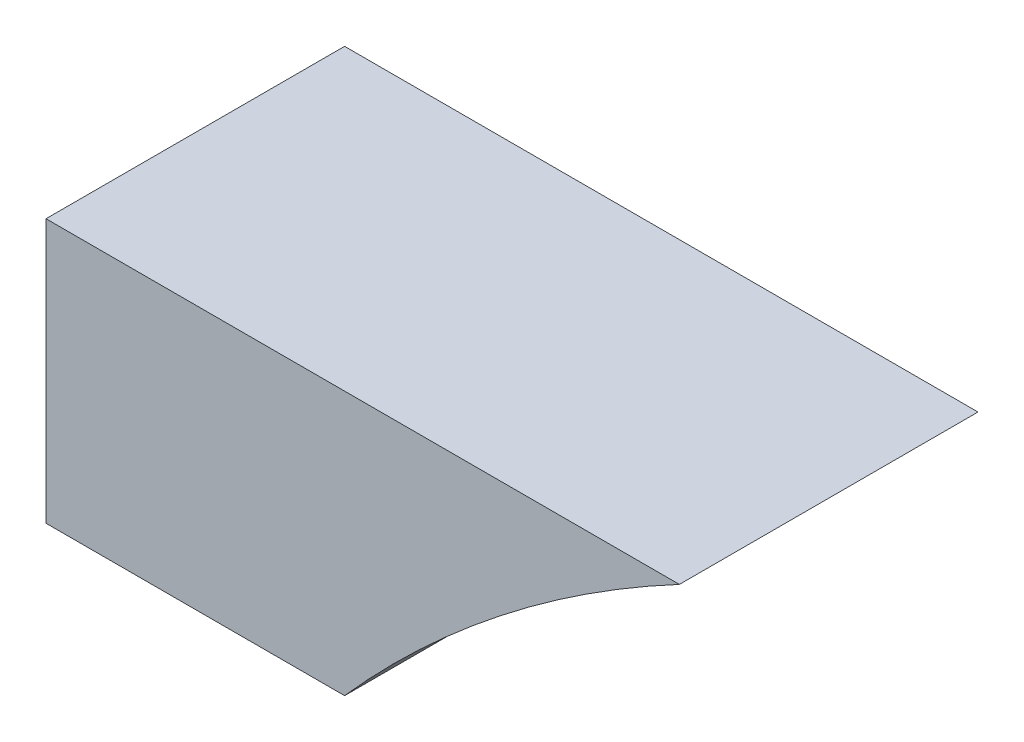
ISO-10303-21;
HEADER;
FILE_DESCRIPTION(('STEP AP214'),'2;1');
FILE_NAME('part.step','',(''),(''),'','','');
FILE_SCHEMA(('AUTOMOTIVE_DESIGN { 1 0 10303 214 1 1 1 1 }'));
ENDSEC;
DATA;
#1=APPLICATION_CONTEXT('core data for automotive mechanical design processes');
#2=APPLICATION_PROTOCOL_DEFINITION('international standard','automotive_design',2000,#1);
#3=PRODUCT_CONTEXT('',#1,'mechanical');
#4=PRODUCT('Part','Part','',(#3));
#5=PRODUCT_RELATED_PRODUCT_CATEGORY('part','',(#4));
#6=PRODUCT_DEFINITION_FORMATION('','',#4);
#7=PRODUCT_DEFINITION_CONTEXT('part definition',#1,'design');
#8=PRODUCT_DEFINITION('design','',#6,#7);
#9=PRODUCT_DEFINITION_SHAPE('','',#8);
#10=(LENGTH_UNIT() NAMED_UNIT(*) SI_UNIT(.MILLI.,.METRE.));
#11=(NAMED_UNIT(*) PLANE_ANGLE_UNIT() SI_UNIT($,.RADIAN.));
#12=(NAMED_UNIT(*) SI_UNIT($,.STERADIAN.) SOLID_ANGLE_UNIT());
#13=UNCERTAINTY_MEASURE_WITH_UNIT(LENGTH_MEASURE(1.E-05),#10,'distance_accuracy_value','');
#14=(GEOMETRIC_REPRESENTATION_CONTEXT(3) GLOBAL_UNCERTAINTY_ASSIGNED_CONTEXT((#13)) GLOBAL_UNIT_ASSIGNED_CONTEXT((#10,
#11,#12)) REPRESENTATION_CONTEXT('',''));
#15=CARTESIAN_POINT('',(0.,0.,0.));
#16=DIRECTION('',(0.,0.,1.));
#17=DIRECTION('',(1.,0.,0.));
#18=AXIS2_PLACEMENT_3D('',#15,#16,#17);
#19=CARTESIAN_POINT('',(-8112.,4992.,624.));
#20=DIRECTION('',(0.,0.,-1.));
#21=DIRECTION('',(-1.,0.,0.));
#22=AXIS2_PLACEMENT_3D('',#19,#20,#21);
#23=CYLINDRICAL_SURFACE('',#22,2496.);
#24=CARTESIAN_POINT('',(-8112.,4992.,0.));
#25=DIRECTION('',(0.,0.,1.));
#26=DIRECTION('',(1.,0.,0.));
#27=AXIS2_PLACEMENT_3D('',#24,#25,#26);
#28=CIRCLE('',#27,2496.);
#29=CARTESIAN_POINT('',(-9281.98844438738,7196.8,0.));
#30=VERTEX_POINT('',#29);
#31=CARTESIAN_POINT('',(-9981.65853566901,6645.6,0.));
#32=VERTEX_POINT('',#31);
#33=EDGE_CURVE('E100',#30,#32,#28,.T.);
#34=ORIENTED_EDGE('',*,*,#33,.F.);
#35=DIRECTION('',(0.,0.,-1.));
#36=VECTOR('',#35,1.);
#37=CARTESIAN_POINT('',(-9281.98844438738,7196.8,624.));
#38=LINE('',#37,#36);
#39=CARTESIAN_POINT('',(-9281.98844438738,7196.8,624.));
#40=VERTEX_POINT('',#39);
#41=EDGE_CURVE('E11',#40,#30,#38,.T.);
#42=ORIENTED_EDGE('',*,*,#41,.F.);
#43=CARTESIAN_POINT('',(-8112.,4992.,624.));
#44=DIRECTION('',(0.,0.,1.));
#45=DIRECTION('',(1.,0.,0.));
#46=AXIS2_PLACEMENT_3D('',#43,#44,#45);
#47=CIRCLE('',#46,2496.);
#48=CARTESIAN_POINT('',(-9981.65853566901,6645.6,624.));
#49=VERTEX_POINT('',#48);
#50=EDGE_CURVE('E93',#40,#49,#47,.T.);
#51=ORIENTED_EDGE('',*,*,#50,.T.);
#52=DIRECTION('',(0.,0.,-1.));
#53=VECTOR('',#52,1.);
#54=CARTESIAN_POINT('',(-9981.65853566901,6645.6,624.));
#55=LINE('',#54,#53);
#56=EDGE_CURVE('E75',#49,#32,#55,.T.);
#57=ORIENTED_EDGE('',*,*,#56,.T.);
#58=EDGE_LOOP('',(#34,#42,#51,#57));
#59=FACE_BOUND('',#58,.T.);
#60=ADVANCED_FACE('F37',(#59),#23,.F.);
#61=CARTESIAN_POINT('',(0.,7196.8,624.));
#62=DIRECTION('',(0.,1.,0.));
#63=DIRECTION('',(0.,0.,1.));
#64=AXIS2_PLACEMENT_3D('',#61,#62,#63);
#65=PLANE('',#64);
#66=DIRECTION('',(1.,0.,0.));
#67=VECTOR('',#66,1.);
#68=CARTESIAN_POINT('',(0.,7196.8,0.));
#69=LINE('',#68,#67);
#70=CARTESIAN_POINT('',(-10605.658535669,7196.8,0.));
#71=VERTEX_POINT('',#70);
#72=EDGE_CURVE('E86',#71,#30,#69,.T.);
#73=ORIENTED_EDGE('',*,*,#72,.F.);
#74=DIRECTION('',(0.,0.,-1.));
#75=VECTOR('',#74,1.);
#76=CARTESIAN_POINT('',(-10605.658535669,7196.8,624.));
#77=LINE('',#76,#75);
#78=CARTESIAN_POINT('',(-10605.658535669,7196.8,624.));
#79=VERTEX_POINT('',#78);
#80=EDGE_CURVE('E45',#79,#71,#77,.T.);
#81=ORIENTED_EDGE('',*,*,#80,.F.);
#82=DIRECTION('',(1.,0.,0.));
#83=VECTOR('',#82,1.);
#84=CARTESIAN_POINT('',(0.,7196.8,624.));
#85=LINE('',#84,#83);
#86=EDGE_CURVE('E84',#79,#40,#85,.T.);
#87=ORIENTED_EDGE('',*,*,#86,.T.);
#88=ORIENTED_EDGE('',*,*,#41,.T.);
#89=EDGE_LOOP('',(#73,#81,#87,#88));
#90=FACE_BOUND('',#89,.T.);
#91=ADVANCED_FACE('F83',(#90),#65,.T.);
#92=CARTESIAN_POINT('',(-10605.658535669,0.,624.));
#93=DIRECTION('',(-1.,0.,0.));
#94=DIRECTION('',(0.,0.,1.));
#95=AXIS2_PLACEMENT_3D('',#92,#93,#94);
#96=PLANE('',#95);
#97=DIRECTION('',(0.,1.,0.));
#98=VECTOR('',#97,1.);
#99=CARTESIAN_POINT('',(-10605.658535669,0.,0.));
#100=LINE('',#99,#98);
#101=CARTESIAN_POINT('',(-10605.658535669,6645.6,0.));
#102=VERTEX_POINT('',#101);
#103=EDGE_CURVE('E104',#102,#71,#100,.T.);
#104=ORIENTED_EDGE('',*,*,#103,.F.);
#105=DIRECTION('',(0.,0.,-1.));
#106=VECTOR('',#105,1.);
#107=CARTESIAN_POINT('',(-10605.658535669,6645.6,624.));
#108=LINE('',#107,#106);
#109=CARTESIAN_POINT('',(-10605.658535669,6645.6,624.));
#110=VERTEX_POINT('',#109);
#111=EDGE_CURVE('E68',#110,#102,#108,.T.);
#112=ORIENTED_EDGE('',*,*,#111,.F.);
#113=DIRECTION('',(0.,1.,0.));
#114=VECTOR('',#113,1.);
#115=CARTESIAN_POINT('',(-10605.658535669,0.,624.));
#116=LINE('',#115,#114);
#117=EDGE_CURVE('E92',#110,#79,#116,.T.);
#118=ORIENTED_EDGE('',*,*,#117,.T.);
#119=ORIENTED_EDGE('',*,*,#80,.T.);
#120=EDGE_LOOP('',(#104,#112,#118,#119));
#121=FACE_BOUND('',#120,.T.);
#122=ADVANCED_FACE('F95',(#121),#96,.T.);
#123=CARTESIAN_POINT('',(0.,6645.6,624.));
#124=DIRECTION('',(0.,1.,0.));
#125=DIRECTION('',(0.,0.,1.));
#126=AXIS2_PLACEMENT_3D('',#123,#124,#125);
#127=PLANE('',#126);
#128=DIRECTION('',(1.,0.,0.));
#129=VECTOR('',#128,1.);
#130=CARTESIAN_POINT('',(0.,6645.6,0.));
#131=LINE('',#130,#129);
#132=EDGE_CURVE('E106',#102,#32,#131,.T.);
#133=ORIENTED_EDGE('',*,*,#132,.T.);
#134=ORIENTED_EDGE('',*,*,#56,.F.);
#135=DIRECTION('',(1.,0.,0.));
#136=VECTOR('',#135,1.);
#137=CARTESIAN_POINT('',(0.,6645.6,624.));
#138=LINE('',#137,#136);
#139=EDGE_CURVE('E53',#110,#49,#138,.T.);
#140=ORIENTED_EDGE('',*,*,#139,.F.);
#141=ORIENTED_EDGE('',*,*,#111,.T.);
#142=EDGE_LOOP('',(#133,#134,#140,#141));
#143=FACE_BOUND('',#142,.T.);
#144=ADVANCED_FACE('F116',(#143),#127,.F.);
#145=CARTESIAN_POINT('',(0.,0.,624.));
#146=DIRECTION('',(0.,0.,1.));
#147=DIRECTION('',(1.,0.,0.));
#148=AXIS2_PLACEMENT_3D('',#145,#146,#147);
#149=PLANE('',#148);
#150=ORIENTED_EDGE('',*,*,#50,.F.);
#151=ORIENTED_EDGE('',*,*,#86,.F.);
#152=ORIENTED_EDGE('',*,*,#117,.F.);
#153=ORIENTED_EDGE('',*,*,#139,.T.);
#154=EDGE_LOOP('',(#150,#151,#152,#153));
#155=FACE_BOUND('',#154,.T.);
#156=ADVANCED_FACE('F91',(#155),#149,.T.);
#157=CARTESIAN_POINT('',(0.,0.,0.));
#158=DIRECTION('',(0.,0.,1.));
#159=DIRECTION('',(1.,0.,0.));
#160=AXIS2_PLACEMENT_3D('',#157,#158,#159);
#161=PLANE('',#160);
#162=ORIENTED_EDGE('',*,*,#33,.T.);
#163=ORIENTED_EDGE('',*,*,#132,.F.);
#164=ORIENTED_EDGE('',*,*,#103,.T.);
#165=ORIENTED_EDGE('',*,*,#72,.T.);
#166=EDGE_LOOP('',(#162,#163,#164,#165));
#167=FACE_BOUND('',#166,.T.);
#168=ADVANCED_FACE('F121',(#167),#161,.F.);
#169=CLOSED_SHELL('',(#60,#91,#122,#144,#156,#168));
#170=MANIFOLD_SOLID_BREP('B2',#169);
#171=ADVANCED_BREP_SHAPE_REPRESENTATION('',(#18,#170),#14);
#172=SHAPE_DEFINITION_REPRESENTATION(#9,#171);
ENDSEC;
END-ISO-10303-21;
